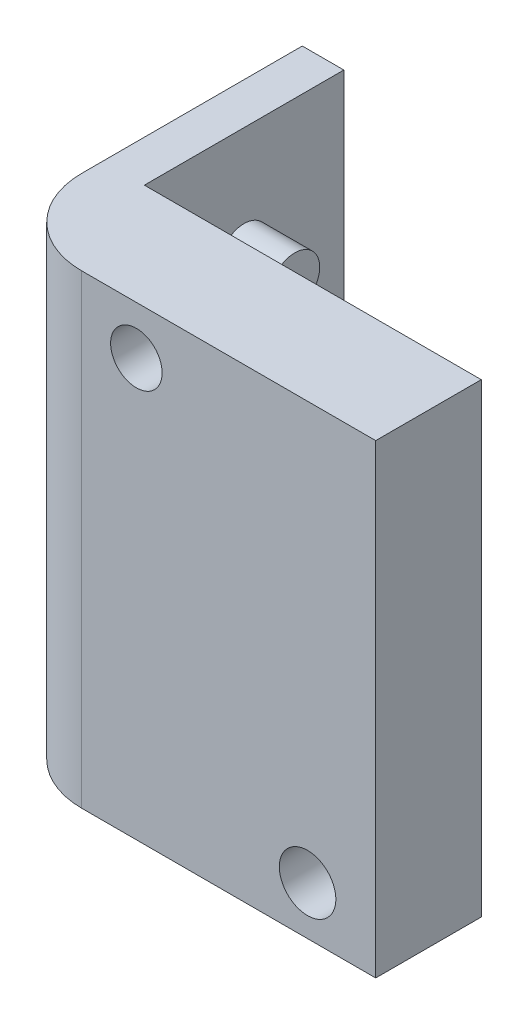
ISO-10303-21;
HEADER;
FILE_DESCRIPTION(('STEP AP214'),'2;1');
FILE_NAME('part.step','',(''),(''),'','','');
FILE_SCHEMA(('AUTOMOTIVE_DESIGN { 1 0 10303 214 1 1 1 1 }'));
ENDSEC;
DATA;
#1=APPLICATION_CONTEXT('core data for automotive mechanical design processes');
#2=APPLICATION_PROTOCOL_DEFINITION('international standard','automotive_design',2000,#1);
#3=PRODUCT_CONTEXT('',#1,'mechanical');
#4=PRODUCT('Part','Part','',(#3));
#5=PRODUCT_RELATED_PRODUCT_CATEGORY('part','',(#4));
#6=PRODUCT_DEFINITION_FORMATION('','',#4);
#7=PRODUCT_DEFINITION_CONTEXT('part definition',#1,'design');
#8=PRODUCT_DEFINITION('design','',#6,#7);
#9=PRODUCT_DEFINITION_SHAPE('','',#8);
#10=(LENGTH_UNIT() NAMED_UNIT(*) SI_UNIT(.MILLI.,.METRE.));
#11=(NAMED_UNIT(*) PLANE_ANGLE_UNIT() SI_UNIT($,.RADIAN.));
#12=(NAMED_UNIT(*) SI_UNIT($,.STERADIAN.) SOLID_ANGLE_UNIT());
#13=UNCERTAINTY_MEASURE_WITH_UNIT(LENGTH_MEASURE(1.E-05),#10,'distance_accuracy_value','');
#14=(GEOMETRIC_REPRESENTATION_CONTEXT(3) GLOBAL_UNCERTAINTY_ASSIGNED_CONTEXT((#13)) GLOBAL_UNIT_ASSIGNED_CONTEXT((#10,
#11,#12)) REPRESENTATION_CONTEXT('',''));
#15=CARTESIAN_POINT('',(0.,0.,0.));
#16=DIRECTION('',(0.,0.,1.));
#17=DIRECTION('',(1.,0.,0.));
#18=AXIS2_PLACEMENT_3D('',#15,#16,#17);
#19=CARTESIAN_POINT('',(-2.5,27.9999948,-18.35));
#20=DIRECTION('',(0.,0.,1.));
#21=DIRECTION('',(1.,0.,0.));
#22=AXIS2_PLACEMENT_3D('',#19,#20,#21);
#23=PLANE('',#22);
#24=DIRECTION('',(-1.,0.,0.));
#25=VECTOR('',#24,1.);
#26=CARTESIAN_POINT('',(-2.5,0.,-18.35));
#27=LINE('',#26,#25);
#28=CARTESIAN_POINT('',(2.5,0.,-18.35));
#29=VERTEX_POINT('',#28);
#30=CARTESIAN_POINT('',(0.,0.,-18.35));
#31=VERTEX_POINT('',#30);
#32=EDGE_CURVE('E115',#29,#31,#27,.T.);
#33=ORIENTED_EDGE('',*,*,#32,.T.);
#34=DIRECTION('',(0.,1.,0.));
#35=VECTOR('',#34,1.);
#36=CARTESIAN_POINT('',(0.,27.9999948,-18.35));
#37=LINE('',#36,#35);
#38=CARTESIAN_POINT('',(0.,27.9999948,-18.35));
#39=VERTEX_POINT('',#38);
#40=EDGE_CURVE('E101',#31,#39,#37,.T.);
#41=ORIENTED_EDGE('',*,*,#40,.T.);
#42=DIRECTION('',(-1.,0.,0.));
#43=VECTOR('',#42,1.);
#44=CARTESIAN_POINT('',(-2.5,27.9999948,-18.35));
#45=LINE('',#44,#43);
#46=CARTESIAN_POINT('',(2.5,27.9999948,-18.35));
#47=VERTEX_POINT('',#46);
#48=EDGE_CURVE('E113',#47,#39,#45,.T.);
#49=ORIENTED_EDGE('',*,*,#48,.F.);
#50=DIRECTION('',(0.,-1.,0.));
#51=VECTOR('',#50,1.);
#52=CARTESIAN_POINT('',(2.5,27.9999948,-18.35));
#53=LINE('',#52,#51);
#54=EDGE_CURVE('E190',#47,#29,#53,.T.);
#55=ORIENTED_EDGE('',*,*,#54,.T.);
#56=EDGE_LOOP('',(#33,#41,#49,#55));
#57=FACE_BOUND('',#56,.T.);
#58=ADVANCED_FACE('F39',(#57),#23,.F.);
#59=CARTESIAN_POINT('',(0.,27.9999948,0.));
#60=DIRECTION('',(0.,0.,-1.));
#61=DIRECTION('',(-1.,0.,0.));
#62=AXIS2_PLACEMENT_3D('',#59,#60,#61);
#63=PLANE('',#62);
#64=CARTESIAN_POINT('',(8.368,25.0999974,0.));
#65=DIRECTION('',(0.,0.,-1.));
#66=DIRECTION('',(-1.,0.,0.));
#67=AXIS2_PLACEMENT_3D('',#64,#65,#66);
#68=CIRCLE('',#67,1.55);
#69=CARTESIAN_POINT('',(6.818,25.0999974,0.));
#70=VERTEX_POINT('',#69);
#71=EDGE_CURVE('E146',#70,#70,#68,.T.);
#72=ORIENTED_EDGE('',*,*,#71,.T.);
#73=EDGE_LOOP('',(#72));
#74=FACE_BOUND('',#73,.T.);
#75=CARTESIAN_POINT('',(18.668,2.8999974,0.));
#76=DIRECTION('',(0.,0.,-1.));
#77=DIRECTION('',(-1.,0.,0.));
#78=AXIS2_PLACEMENT_3D('',#75,#76,#77);
#79=CIRCLE('',#78,1.7);
#80=CARTESIAN_POINT('',(16.968,2.8999974,0.));
#81=VERTEX_POINT('',#80);
#82=EDGE_CURVE('E154',#81,#81,#79,.T.);
#83=ORIENTED_EDGE('',*,*,#82,.T.);
#84=EDGE_LOOP('',(#83));
#85=FACE_BOUND('',#84,.T.);
#86=DIRECTION('',(1.,0.,0.));
#87=VECTOR('',#86,1.);
#88=CARTESIAN_POINT('',(0.,27.9999948,0.));
#89=LINE('',#88,#87);
#90=CARTESIAN_POINT('',(5.08,27.9999948,0.));
#91=VERTEX_POINT('',#90);
#92=CARTESIAN_POINT('',(22.7671934,27.9999948,0.));
#93=VERTEX_POINT('',#92);
#94=EDGE_CURVE('E124',#91,#93,#89,.T.);
#95=ORIENTED_EDGE('',*,*,#94,.F.);
#96=DIRECTION('',(0.,1.,0.));
#97=VECTOR('',#96,1.);
#98=CARTESIAN_POINT('',(5.08,27.9999948,0.));
#99=LINE('',#98,#97);
#100=CARTESIAN_POINT('',(5.08,0.,0.));
#101=VERTEX_POINT('',#100);
#102=EDGE_CURVE('E48',#91,#101,#99,.F.);
#103=ORIENTED_EDGE('',*,*,#102,.T.);
#104=DIRECTION('',(1.,0.,0.));
#105=VECTOR('',#104,1.);
#106=CARTESIAN_POINT('',(0.,0.,0.));
#107=LINE('',#106,#105);
#108=CARTESIAN_POINT('',(22.7671934,0.,0.));
#109=VERTEX_POINT('',#108);
#110=EDGE_CURVE('E125',#101,#109,#107,.T.);
#111=ORIENTED_EDGE('',*,*,#110,.T.);
#112=DIRECTION('',(0.,-1.,0.));
#113=VECTOR('',#112,1.);
#114=CARTESIAN_POINT('',(22.7671934,27.9999948,0.));
#115=LINE('',#114,#113);
#116=EDGE_CURVE('E133',#93,#109,#115,.T.);
#117=ORIENTED_EDGE('',*,*,#116,.F.);
#118=EDGE_LOOP('',(#95,#103,#111,#117));
#119=FACE_BOUND('',#118,.T.);
#120=ADVANCED_FACE('F239',(#74,#85,#119),#63,.F.);
#121=CARTESIAN_POINT('',(0.,27.9999948,0.));
#122=DIRECTION('',(0.,-1.,0.));
#123=DIRECTION('',(0.,0.,-1.));
#124=AXIS2_PLACEMENT_3D('',#121,#122,#123);
#125=PLANE('',#124);
#126=DIRECTION('',(0.,0.,1.));
#127=VECTOR('',#126,1.);
#128=CARTESIAN_POINT('',(0.,27.9999948,-18.35));
#129=LINE('',#128,#127);
#130=CARTESIAN_POINT('',(0.,27.9999948,-5.08));
#131=VERTEX_POINT('',#130);
#132=EDGE_CURVE('E96',#39,#131,#129,.T.);
#133=ORIENTED_EDGE('',*,*,#132,.T.);
#134=CARTESIAN_POINT('',(5.08,27.9999948,-5.08));
#135=DIRECTION('',(0.,-1.,0.));
#136=DIRECTION('',(0.,0.,-1.));
#137=AXIS2_PLACEMENT_3D('',#134,#135,#136);
#138=CIRCLE('',#137,5.08);
#139=EDGE_CURVE('E62',#131,#91,#138,.F.);
#140=ORIENTED_EDGE('',*,*,#139,.T.);
#141=ORIENTED_EDGE('',*,*,#94,.T.);
#142=DIRECTION('',(0.,0.,1.));
#143=VECTOR('',#142,1.);
#144=CARTESIAN_POINT('',(22.7671934,27.9999948,0.));
#145=LINE('',#144,#143);
#146=CARTESIAN_POINT('',(22.7671934,27.9999948,-6.35));
#147=VERTEX_POINT('',#146);
#148=EDGE_CURVE('E179',#147,#93,#145,.T.);
#149=ORIENTED_EDGE('',*,*,#148,.F.);
#150=DIRECTION('',(1.,0.,0.));
#151=VECTOR('',#150,1.);
#152=CARTESIAN_POINT('',(22.7671934,27.9999948,-6.35));
#153=LINE('',#152,#151);
#154=CARTESIAN_POINT('',(2.5,27.9999948,-6.35));
#155=VERTEX_POINT('',#154);
#156=EDGE_CURVE('E183',#155,#147,#153,.T.);
#157=ORIENTED_EDGE('',*,*,#156,.F.);
#158=DIRECTION('',(0.,0.,1.));
#159=VECTOR('',#158,1.);
#160=CARTESIAN_POINT('',(2.5,27.9999948,-6.35));
#161=LINE('',#160,#159);
#162=EDGE_CURVE('E122',#47,#155,#161,.T.);
#163=ORIENTED_EDGE('',*,*,#162,.F.);
#164=ORIENTED_EDGE('',*,*,#48,.T.);
#165=EDGE_LOOP('',(#133,#140,#141,#149,#157,#163,#164));
#166=FACE_BOUND('',#165,.T.);
#167=ADVANCED_FACE('F119',(#166),#125,.F.);
#168=CARTESIAN_POINT('',(0.,0.,0.));
#169=DIRECTION('',(0.,-1.,0.));
#170=DIRECTION('',(0.,0.,-1.));
#171=AXIS2_PLACEMENT_3D('',#168,#169,#170);
#172=PLANE('',#171);
#173=ORIENTED_EDGE('',*,*,#110,.F.);
#174=CARTESIAN_POINT('',(5.08,0.,-5.08));
#175=DIRECTION('',(0.,-1.,0.));
#176=DIRECTION('',(0.,0.,-1.));
#177=AXIS2_PLACEMENT_3D('',#174,#175,#176);
#178=CIRCLE('',#177,5.08);
#179=CARTESIAN_POINT('',(0.,0.,-5.08));
#180=VERTEX_POINT('',#179);
#181=EDGE_CURVE('E11',#101,#180,#178,.T.);
#182=ORIENTED_EDGE('',*,*,#181,.T.);
#183=DIRECTION('',(0.,0.,1.));
#184=VECTOR('',#183,1.);
#185=CARTESIAN_POINT('',(0.,0.,-18.35));
#186=LINE('',#185,#184);
#187=EDGE_CURVE('E108',#31,#180,#186,.T.);
#188=ORIENTED_EDGE('',*,*,#187,.F.);
#189=ORIENTED_EDGE('',*,*,#32,.F.);
#190=DIRECTION('',(0.,0.,1.));
#191=VECTOR('',#190,1.);
#192=CARTESIAN_POINT('',(2.5,0.,-6.35));
#193=LINE('',#192,#191);
#194=CARTESIAN_POINT('',(2.5,0.,-6.35));
#195=VERTEX_POINT('',#194);
#196=EDGE_CURVE('E184',#29,#195,#193,.T.);
#197=ORIENTED_EDGE('',*,*,#196,.T.);
#198=DIRECTION('',(1.,0.,0.));
#199=VECTOR('',#198,1.);
#200=CARTESIAN_POINT('',(22.7671934,0.,-6.35));
#201=LINE('',#200,#199);
#202=CARTESIAN_POINT('',(22.7671934,0.,-6.35));
#203=VERTEX_POINT('',#202);
#204=EDGE_CURVE('E194',#195,#203,#201,.T.);
#205=ORIENTED_EDGE('',*,*,#204,.T.);
#206=DIRECTION('',(0.,0.,1.));
#207=VECTOR('',#206,1.);
#208=CARTESIAN_POINT('',(22.7671934,0.,0.));
#209=LINE('',#208,#207);
#210=EDGE_CURVE('E178',#203,#109,#209,.T.);
#211=ORIENTED_EDGE('',*,*,#210,.T.);
#212=EDGE_LOOP('',(#173,#182,#188,#189,#197,#205,#211));
#213=FACE_BOUND('',#212,.T.);
#214=ADVANCED_FACE('F217',(#213),#172,.T.);
#215=CARTESIAN_POINT('',(0.,6.4999997,-12.35));
#216=DIRECTION('',(-1.,0.,0.));
#217=DIRECTION('',(0.,0.,1.));
#218=AXIS2_PLACEMENT_3D('',#215,#216,#217);
#219=CYLINDRICAL_SURFACE('',#218,1.5);
#220=CARTESIAN_POINT('',(0.,6.4999997,-12.35));
#221=DIRECTION('',(1.,0.,0.));
#222=DIRECTION('',(0.,0.,-1.));
#223=AXIS2_PLACEMENT_3D('',#220,#221,#222);
#224=CIRCLE('',#223,1.5);
#225=CARTESIAN_POINT('',(0.,6.4999997,-13.85));
#226=VERTEX_POINT('',#225);
#227=EDGE_CURVE('E107',#226,#226,#224,.F.);
#228=ORIENTED_EDGE('',*,*,#227,.T.);
#229=EDGE_LOOP('',(#228));
#230=FACE_BOUND('',#229,.T.);
#231=CARTESIAN_POINT('',(2.50000000000001,6.4999997,-12.35));
#232=DIRECTION('',(-1.,0.,0.));
#233=DIRECTION('',(0.,0.,1.));
#234=AXIS2_PLACEMENT_3D('',#231,#232,#233);
#235=CIRCLE('',#234,1.5);
#236=CARTESIAN_POINT('',(2.50000000000001,6.4999997,-10.85));
#237=VERTEX_POINT('',#236);
#238=EDGE_CURVE('E174',#237,#237,#235,.T.);
#239=ORIENTED_EDGE('',*,*,#238,.F.);
#240=EDGE_LOOP('',(#239));
#241=FACE_BOUND('',#240,.T.);
#242=ADVANCED_FACE('F248',(#230,#241),#219,.F.);
#243=CARTESIAN_POINT('',(22.7671934,27.9999948,0.));
#244=DIRECTION('',(1.,0.,0.));
#245=DIRECTION('',(0.,0.,-1.));
#246=AXIS2_PLACEMENT_3D('',#243,#244,#245);
#247=PLANE('',#246);
#248=ORIENTED_EDGE('',*,*,#210,.F.);
#249=DIRECTION('',(0.,-1.,0.));
#250=VECTOR('',#249,1.);
#251=CARTESIAN_POINT('',(22.7671934,27.9999948,-6.35));
#252=LINE('',#251,#250);
#253=EDGE_CURVE('E205',#147,#203,#252,.T.);
#254=ORIENTED_EDGE('',*,*,#253,.F.);
#255=ORIENTED_EDGE('',*,*,#148,.T.);
#256=ORIENTED_EDGE('',*,*,#116,.T.);
#257=EDGE_LOOP('',(#248,#254,#255,#256));
#258=FACE_BOUND('',#257,.T.);
#259=ADVANCED_FACE('F214',(#258),#247,.T.);
#260=CARTESIAN_POINT('',(22.7671934,27.9999948,-6.35));
#261=DIRECTION('',(0.,0.,-1.));
#262=DIRECTION('',(-1.,0.,0.));
#263=AXIS2_PLACEMENT_3D('',#260,#261,#262);
#264=PLANE('',#263);
#265=CARTESIAN_POINT('',(8.368,25.0999974,-6.35));
#266=DIRECTION('',(0.,0.,-1.));
#267=DIRECTION('',(-1.,0.,0.));
#268=AXIS2_PLACEMENT_3D('',#265,#266,#267);
#269=CIRCLE('',#268,1.55);
#270=CARTESIAN_POINT('',(6.818,25.0999974,-6.35));
#271=VERTEX_POINT('',#270);
#272=EDGE_CURVE('E145',#271,#271,#269,.F.);
#273=ORIENTED_EDGE('',*,*,#272,.T.);
#274=EDGE_LOOP('',(#273));
#275=FACE_BOUND('',#274,.T.);
#276=CARTESIAN_POINT('',(18.668,2.8999974,-6.35));
#277=DIRECTION('',(0.,0.,-1.));
#278=DIRECTION('',(-1.,0.,0.));
#279=AXIS2_PLACEMENT_3D('',#276,#277,#278);
#280=CIRCLE('',#279,1.7);
#281=CARTESIAN_POINT('',(16.968,2.8999974,-6.35));
#282=VERTEX_POINT('',#281);
#283=EDGE_CURVE('E141',#282,#282,#280,.F.);
#284=ORIENTED_EDGE('',*,*,#283,.T.);
#285=EDGE_LOOP('',(#284));
#286=FACE_BOUND('',#285,.T.);
#287=ORIENTED_EDGE('',*,*,#204,.F.);
#288=DIRECTION('',(0.,-1.,0.));
#289=VECTOR('',#288,1.);
#290=CARTESIAN_POINT('',(2.5,27.9999948,-6.35));
#291=LINE('',#290,#289);
#292=EDGE_CURVE('E203',#155,#195,#291,.T.);
#293=ORIENTED_EDGE('',*,*,#292,.F.);
#294=ORIENTED_EDGE('',*,*,#156,.T.);
#295=ORIENTED_EDGE('',*,*,#253,.T.);
#296=EDGE_LOOP('',(#287,#293,#294,#295));
#297=FACE_BOUND('',#296,.T.);
#298=ADVANCED_FACE('F220',(#275,#286,#297),#264,.T.);
#299=CARTESIAN_POINT('',(2.5,27.9999948,-6.35));
#300=DIRECTION('',(1.,0.,0.));
#301=DIRECTION('',(0.,0.,-1.));
#302=AXIS2_PLACEMENT_3D('',#299,#300,#301);
#303=PLANE('',#302);
#304=CARTESIAN_POINT('',(2.5,21.4999951,-12.35));
#305=DIRECTION('',(1.,0.,0.));
#306=DIRECTION('',(0.,0.,-1.));
#307=AXIS2_PLACEMENT_3D('',#304,#305,#306);
#308=CIRCLE('',#307,1.5);
#309=CARTESIAN_POINT('',(2.5,21.4999951,-13.85));
#310=VERTEX_POINT('',#309);
#311=EDGE_CURVE('E129',#310,#310,#308,.T.);
#312=ORIENTED_EDGE('',*,*,#311,.F.);
#313=EDGE_LOOP('',(#312));
#314=FACE_BOUND('',#313,.T.);
#315=ORIENTED_EDGE('',*,*,#238,.T.);
#316=EDGE_LOOP('',(#315));
#317=FACE_BOUND('',#316,.T.);
#318=ORIENTED_EDGE('',*,*,#196,.F.);
#319=ORIENTED_EDGE('',*,*,#54,.F.);
#320=ORIENTED_EDGE('',*,*,#162,.T.);
#321=ORIENTED_EDGE('',*,*,#292,.T.);
#322=EDGE_LOOP('',(#318,#319,#320,#321));
#323=FACE_BOUND('',#322,.T.);
#324=ADVANCED_FACE('F222',(#314,#317,#323),#303,.T.);
#325=CARTESIAN_POINT('',(5.54800000000001,21.4999951,-12.35));
#326=DIRECTION('',(-1.,0.,0.));
#327=DIRECTION('',(0.,0.,1.));
#328=AXIS2_PLACEMENT_3D('',#325,#326,#327);
#329=CYLINDRICAL_SURFACE('',#328,1.5);
#330=CARTESIAN_POINT('',(5.54800000000001,21.4999951,-12.35));
#331=DIRECTION('',(-1.,0.,0.));
#332=DIRECTION('',(0.,0.,1.));
#333=AXIS2_PLACEMENT_3D('',#330,#331,#332);
#334=CIRCLE('',#333,1.5);
#335=CARTESIAN_POINT('',(5.54800000000001,21.4999951,-10.85));
#336=VERTEX_POINT('',#335);
#337=EDGE_CURVE('E150',#336,#336,#334,.T.);
#338=ORIENTED_EDGE('',*,*,#337,.T.);
#339=EDGE_LOOP('',(#338));
#340=FACE_BOUND('',#339,.T.);
#341=ORIENTED_EDGE('',*,*,#311,.T.);
#342=EDGE_LOOP('',(#341));
#343=FACE_BOUND('',#342,.T.);
#344=ADVANCED_FACE('F224',(#340,#343),#329,.T.);
#345=CARTESIAN_POINT('',(5.54800000000001,0.,0.));
#346=DIRECTION('',(1.,0.,0.));
#347=DIRECTION('',(0.,0.,1.));
#348=AXIS2_PLACEMENT_3D('',#345,#346,#347);
#349=PLANE('',#348);
#350=ORIENTED_EDGE('',*,*,#337,.F.);
#351=EDGE_LOOP('',(#350));
#352=FACE_BOUND('',#351,.T.);
#353=ADVANCED_FACE('F231',(#352),#349,.T.);
#354=CARTESIAN_POINT('',(18.668,2.8999974,-18.35));
#355=DIRECTION('',(0.,0.,1.));
#356=DIRECTION('',(1.,0.,0.));
#357=AXIS2_PLACEMENT_3D('',#354,#355,#356);
#358=CYLINDRICAL_SURFACE('',#357,1.7);
#359=ORIENTED_EDGE('',*,*,#283,.F.);
#360=EDGE_LOOP('',(#359));
#361=FACE_BOUND('',#360,.T.);
#362=ORIENTED_EDGE('',*,*,#82,.F.);
#363=EDGE_LOOP('',(#362));
#364=FACE_BOUND('',#363,.T.);
#365=ADVANCED_FACE('F282',(#361,#364),#358,.F.);
#366=CARTESIAN_POINT('',(8.368,25.0999974,-18.35));
#367=DIRECTION('',(0.,0.,1.));
#368=DIRECTION('',(1.,0.,0.));
#369=AXIS2_PLACEMENT_3D('',#366,#367,#368);
#370=CYLINDRICAL_SURFACE('',#369,1.55);
#371=ORIENTED_EDGE('',*,*,#272,.F.);
#372=EDGE_LOOP('',(#371));
#373=FACE_BOUND('',#372,.T.);
#374=ORIENTED_EDGE('',*,*,#71,.F.);
#375=EDGE_LOOP('',(#374));
#376=FACE_BOUND('',#375,.T.);
#377=ADVANCED_FACE('F292',(#373,#376),#370,.F.);
#378=CARTESIAN_POINT('',(0.,27.9999948,-18.35));
#379=DIRECTION('',(1.,0.,0.));
#380=DIRECTION('',(0.,0.,-1.));
#381=AXIS2_PLACEMENT_3D('',#378,#379,#380);
#382=PLANE('',#381);
#383=ORIENTED_EDGE('',*,*,#187,.T.);
#384=DIRECTION('',(0.,1.,0.));
#385=VECTOR('',#384,1.);
#386=CARTESIAN_POINT('',(0.,27.9999948,-5.08));
#387=LINE('',#386,#385);
#388=EDGE_CURVE('E104',#180,#131,#387,.T.);
#389=ORIENTED_EDGE('',*,*,#388,.T.);
#390=ORIENTED_EDGE('',*,*,#132,.F.);
#391=ORIENTED_EDGE('',*,*,#40,.F.);
#392=EDGE_LOOP('',(#383,#389,#390,#391));
#393=FACE_BOUND('',#392,.T.);
#394=ORIENTED_EDGE('',*,*,#227,.F.);
#395=EDGE_LOOP('',(#394));
#396=FACE_BOUND('',#395,.T.);
#397=ADVANCED_FACE('F99',(#393,#396),#382,.F.);
#398=CARTESIAN_POINT('',(5.08,27.9999948,-5.08));
#399=DIRECTION('',(0.,1.,0.));
#400=DIRECTION('',(0.,0.,1.));
#401=AXIS2_PLACEMENT_3D('',#398,#399,#400);
#402=CYLINDRICAL_SURFACE('',#401,5.08);
#403=ORIENTED_EDGE('',*,*,#181,.F.);
#404=ORIENTED_EDGE('',*,*,#102,.F.);
#405=ORIENTED_EDGE('',*,*,#139,.F.);
#406=ORIENTED_EDGE('',*,*,#388,.F.);
#407=EDGE_LOOP('',(#403,#404,#405,#406));
#408=FACE_BOUND('',#407,.T.);
#409=ADVANCED_FACE('F41',(#408),#402,.T.);
#410=CLOSED_SHELL('',(#58,#120,#167,#214,#242,#259,#298,#324,#344,#353,#365,#377,#397,#409));
#411=MANIFOLD_SOLID_BREP('B2',#410);
#412=ADVANCED_BREP_SHAPE_REPRESENTATION('',(#18,#411),#14);
#413=SHAPE_DEFINITION_REPRESENTATION(#9,#412);
ENDSEC;
END-ISO-10303-21;
